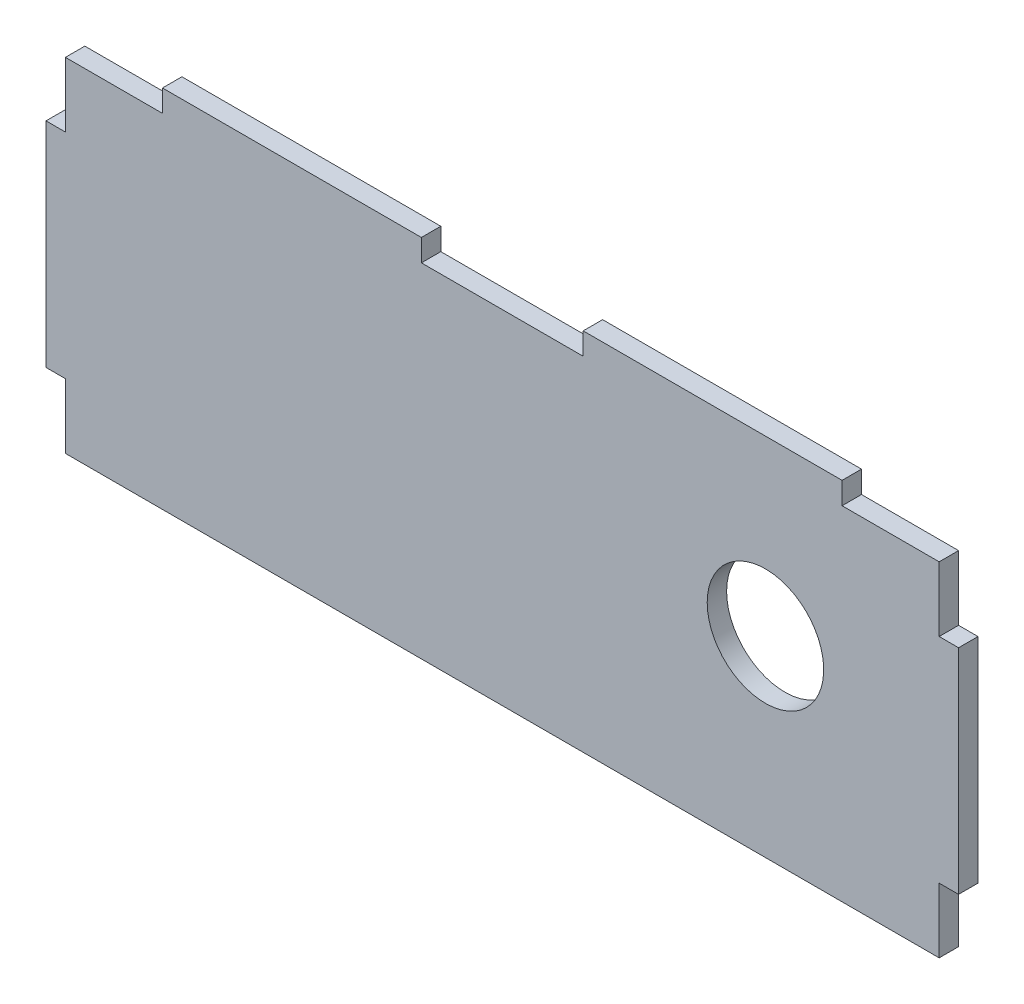
ISO-10303-21;
HEADER;
FILE_DESCRIPTION(('STEP AP214'),'2;1');
FILE_NAME('part.step','',(''),(''),'','','');
FILE_SCHEMA(('AUTOMOTIVE_DESIGN { 1 0 10303 214 1 1 1 1 }'));
ENDSEC;
DATA;
#1=APPLICATION_CONTEXT('core data for automotive mechanical design processes');
#2=APPLICATION_PROTOCOL_DEFINITION('international standard','automotive_design',2000,#1);
#3=PRODUCT_CONTEXT('',#1,'mechanical');
#4=PRODUCT('Part','Part','',(#3));
#5=PRODUCT_RELATED_PRODUCT_CATEGORY('part','',(#4));
#6=PRODUCT_DEFINITION_FORMATION('','',#4);
#7=PRODUCT_DEFINITION_CONTEXT('part definition',#1,'design');
#8=PRODUCT_DEFINITION('design','',#6,#7);
#9=PRODUCT_DEFINITION_SHAPE('','',#8);
#10=(LENGTH_UNIT() NAMED_UNIT(*) SI_UNIT(.MILLI.,.METRE.));
#11=(NAMED_UNIT(*) PLANE_ANGLE_UNIT() SI_UNIT($,.RADIAN.));
#12=(NAMED_UNIT(*) SI_UNIT($,.STERADIAN.) SOLID_ANGLE_UNIT());
#13=UNCERTAINTY_MEASURE_WITH_UNIT(LENGTH_MEASURE(1.E-05),#10,'distance_accuracy_value','');
#14=(GEOMETRIC_REPRESENTATION_CONTEXT(3) GLOBAL_UNCERTAINTY_ASSIGNED_CONTEXT((#13)) GLOBAL_UNIT_ASSIGNED_CONTEXT((#10,
#11,#12)) REPRESENTATION_CONTEXT('',''));
#15=CARTESIAN_POINT('',(0.,0.,0.));
#16=DIRECTION('',(0.,0.,1.));
#17=DIRECTION('',(1.,0.,0.));
#18=AXIS2_PLACEMENT_3D('',#15,#16,#17);
#19=CARTESIAN_POINT('',(26.4374074339526,-18.5355283268753,3.));
#20=DIRECTION('',(0.,-1.,0.));
#21=DIRECTION('',(1.,0.,0.));
#22=AXIS2_PLACEMENT_3D('',#19,#20,#21);
#23=PLANE('',#22);
#24=DIRECTION('',(0.,0.,1.));
#25=VECTOR('',#24,1.);
#26=CARTESIAN_POINT('',(-28.5625925660474,-18.5355283268753,0.));
#27=LINE('',#26,#25);
#28=CARTESIAN_POINT('',(-28.5625925660474,-18.5355283268753,0.));
#29=VERTEX_POINT('',#28);
#30=CARTESIAN_POINT('',(-28.5625925660474,-18.5355283268753,3.));
#31=VERTEX_POINT('',#30);
#32=EDGE_CURVE('E208',#29,#31,#27,.T.);
#33=ORIENTED_EDGE('',*,*,#32,.F.);
#34=DIRECTION('',(-1.,0.,0.));
#35=VECTOR('',#34,1.);
#36=CARTESIAN_POINT('',(26.4374074339526,-18.5355283268753,0.));
#37=LINE('',#36,#35);
#38=CARTESIAN_POINT('',(-53.5625925660474,-18.5355283268753,0.));
#39=VERTEX_POINT('',#38);
#40=EDGE_CURVE('E330',#29,#39,#37,.T.);
#41=ORIENTED_EDGE('',*,*,#40,.T.);
#42=DIRECTION('',(0.,0.,-1.));
#43=VECTOR('',#42,1.);
#44=CARTESIAN_POINT('',(-53.5625925660474,-18.5355283268753,0.));
#45=LINE('',#44,#43);
#46=CARTESIAN_POINT('',(-53.5625925660474,-18.5355283268753,3.));
#47=VERTEX_POINT('',#46);
#48=EDGE_CURVE('E217',#47,#39,#45,.T.);
#49=ORIENTED_EDGE('',*,*,#48,.F.);
#50=DIRECTION('',(-1.,0.,0.));
#51=VECTOR('',#50,1.);
#52=CARTESIAN_POINT('',(26.4374074339526,-18.5355283268753,3.));
#53=LINE('',#52,#51);
#54=EDGE_CURVE('E54',#31,#47,#53,.T.);
#55=ORIENTED_EDGE('',*,*,#54,.F.);
#56=EDGE_LOOP('',(#33,#41,#49,#55));
#57=FACE_BOUND('',#56,.T.);
#58=ADVANCED_FACE('F39',(#57),#23,.F.);
#59=DIRECTION('',(0.,0.,-1.));
#60=VECTOR('',#59,1.);
#61=CARTESIAN_POINT('',(11.4374074339526,-18.5355283268753,0.));
#62=LINE('',#61,#60);
#63=CARTESIAN_POINT('',(11.4374074339526,-18.5355283268753,3.));
#64=VERTEX_POINT('',#63);
#65=CARTESIAN_POINT('',(11.4374074339526,-18.5355283268753,0.));
#66=VERTEX_POINT('',#65);
#67=EDGE_CURVE('E62',#64,#66,#62,.T.);
#68=ORIENTED_EDGE('',*,*,#67,.F.);
#69=CARTESIAN_POINT('',(26.4374074339526,-18.5355283268753,3.));
#70=VERTEX_POINT('',#69);
#71=EDGE_CURVE('E315',#70,#64,#53,.T.);
#72=ORIENTED_EDGE('',*,*,#71,.F.);
#73=DIRECTION('',(0.,0.,-1.));
#74=VECTOR('',#73,1.);
#75=CARTESIAN_POINT('',(26.4374074339526,-18.5355283268753,3.));
#76=LINE('',#75,#74);
#77=CARTESIAN_POINT('',(26.4374074339526,-18.5355283268753,0.));
#78=VERTEX_POINT('',#77);
#79=EDGE_CURVE('E11',#70,#78,#76,.T.);
#80=ORIENTED_EDGE('',*,*,#79,.T.);
#81=EDGE_CURVE('E327',#78,#66,#37,.T.);
#82=ORIENTED_EDGE('',*,*,#81,.T.);
#83=EDGE_LOOP('',(#68,#72,#80,#82));
#84=FACE_BOUND('',#83,.T.);
#85=ADVANCED_FACE('F368',(#84),#23,.F.);
#86=DIRECTION('',(0.,0.,1.));
#87=VECTOR('',#86,1.);
#88=CARTESIAN_POINT('',(-93.5625925660474,-18.5355283268753,0.));
#89=LINE('',#88,#87);
#90=CARTESIAN_POINT('',(-93.5625925660474,-18.5355283268753,0.));
#91=VERTEX_POINT('',#90);
#92=CARTESIAN_POINT('',(-93.5625925660474,-18.5355283268753,3.));
#93=VERTEX_POINT('',#92);
#94=EDGE_CURVE('E204',#91,#93,#89,.T.);
#95=ORIENTED_EDGE('',*,*,#94,.F.);
#96=CARTESIAN_POINT('',(-108.562592566047,-18.5355283268753,0.));
#97=VERTEX_POINT('',#96);
#98=EDGE_CURVE('E326',#91,#97,#37,.T.);
#99=ORIENTED_EDGE('',*,*,#98,.T.);
#100=DIRECTION('',(0.,0.,-1.));
#101=VECTOR('',#100,1.);
#102=CARTESIAN_POINT('',(-108.562592566047,-18.5355283268753,3.));
#103=LINE('',#102,#101);
#104=CARTESIAN_POINT('',(-108.562592566047,-18.5355283268753,3.));
#105=VERTEX_POINT('',#104);
#106=EDGE_CURVE('E47',#105,#97,#103,.T.);
#107=ORIENTED_EDGE('',*,*,#106,.F.);
#108=EDGE_CURVE('E313',#93,#105,#53,.T.);
#109=ORIENTED_EDGE('',*,*,#108,.F.);
#110=EDGE_LOOP('',(#95,#99,#107,#109));
#111=FACE_BOUND('',#110,.T.);
#112=ADVANCED_FACE('F366',(#111),#23,.F.);
#113=CARTESIAN_POINT('',(-108.562592566047,-18.5355283268753,3.));
#114=DIRECTION('',(1.,0.,0.));
#115=DIRECTION('',(0.,1.,0.));
#116=AXIS2_PLACEMENT_3D('',#113,#114,#115);
#117=PLANE('',#116);
#118=DIRECTION('',(0.,0.,-1.));
#119=VECTOR('',#118,1.);
#120=CARTESIAN_POINT('',(-108.562592566047,-28.5355283268753,0.));
#121=LINE('',#120,#119);
#122=CARTESIAN_POINT('',(-108.562592566047,-28.5355283268753,3.));
#123=VERTEX_POINT('',#122);
#124=CARTESIAN_POINT('',(-108.562592566047,-28.5355283268753,0.));
#125=VERTEX_POINT('',#124);
#126=EDGE_CURVE('E257',#123,#125,#121,.T.);
#127=ORIENTED_EDGE('',*,*,#126,.F.);
#128=DIRECTION('',(0.,-1.,0.));
#129=VECTOR('',#128,1.);
#130=CARTESIAN_POINT('',(-108.562592566047,-18.5355283268753,3.));
#131=LINE('',#130,#129);
#132=EDGE_CURVE('E318',#105,#123,#131,.T.);
#133=ORIENTED_EDGE('',*,*,#132,.F.);
#134=ORIENTED_EDGE('',*,*,#106,.T.);
#135=DIRECTION('',(0.,-1.,0.));
#136=VECTOR('',#135,1.);
#137=CARTESIAN_POINT('',(-108.562592566047,-18.5355283268753,0.));
#138=LINE('',#137,#136);
#139=EDGE_CURVE('E331',#97,#125,#138,.T.);
#140=ORIENTED_EDGE('',*,*,#139,.T.);
#141=EDGE_LOOP('',(#127,#133,#134,#140));
#142=FACE_BOUND('',#141,.T.);
#143=ADVANCED_FACE('F344',(#142),#117,.F.);
#144=DIRECTION('',(0.,0.,1.));
#145=VECTOR('',#144,1.);
#146=CARTESIAN_POINT('',(-108.562592566047,-61.5355283268753,0.));
#147=LINE('',#146,#145);
#148=CARTESIAN_POINT('',(-108.562592566047,-61.5355283268753,0.));
#149=VERTEX_POINT('',#148);
#150=CARTESIAN_POINT('',(-108.562592566047,-61.5355283268753,3.));
#151=VERTEX_POINT('',#150);
#152=EDGE_CURVE('E228',#149,#151,#147,.T.);
#153=ORIENTED_EDGE('',*,*,#152,.F.);
#154=CARTESIAN_POINT('',(-108.562592566047,-71.5355283268753,0.));
#155=VERTEX_POINT('',#154);
#156=EDGE_CURVE('E329',#149,#155,#138,.T.);
#157=ORIENTED_EDGE('',*,*,#156,.T.);
#158=DIRECTION('',(0.,0.,-1.));
#159=VECTOR('',#158,1.);
#160=CARTESIAN_POINT('',(-108.562592566047,-71.5355283268753,3.));
#161=LINE('',#160,#159);
#162=CARTESIAN_POINT('',(-108.562592566047,-71.5355283268753,3.));
#163=VERTEX_POINT('',#162);
#164=EDGE_CURVE('E337',#163,#155,#161,.T.);
#165=ORIENTED_EDGE('',*,*,#164,.F.);
#166=EDGE_CURVE('E317',#151,#163,#131,.T.);
#167=ORIENTED_EDGE('',*,*,#166,.F.);
#168=EDGE_LOOP('',(#153,#157,#165,#167));
#169=FACE_BOUND('',#168,.T.);
#170=ADVANCED_FACE('F373',(#169),#117,.F.);
#171=CARTESIAN_POINT('',(26.4374074339526,-18.5355283268753,3.));
#172=DIRECTION('',(-1.,0.,0.));
#173=DIRECTION('',(0.,-1.,0.));
#174=AXIS2_PLACEMENT_3D('',#171,#172,#173);
#175=PLANE('',#174);
#176=DIRECTION('',(0.,0.,-1.));
#177=VECTOR('',#176,1.);
#178=CARTESIAN_POINT('',(26.4374074339526,-61.5355283268753,0.));
#179=LINE('',#178,#177);
#180=CARTESIAN_POINT('',(26.4374074339526,-61.5355283268753,3.));
#181=VERTEX_POINT('',#180);
#182=CARTESIAN_POINT('',(26.4374074339526,-61.5355283268753,0.));
#183=VERTEX_POINT('',#182);
#184=EDGE_CURVE('E287',#181,#183,#179,.T.);
#185=ORIENTED_EDGE('',*,*,#184,.F.);
#186=DIRECTION('',(0.,1.,0.));
#187=VECTOR('',#186,1.);
#188=CARTESIAN_POINT('',(26.4374074339526,-18.5355283268753,3.));
#189=LINE('',#188,#187);
#190=CARTESIAN_POINT('',(26.4374074339526,-71.5355283268753,3.));
#191=VERTEX_POINT('',#190);
#192=EDGE_CURVE('E310',#191,#181,#189,.T.);
#193=ORIENTED_EDGE('',*,*,#192,.F.);
#194=DIRECTION('',(0.,0.,-1.));
#195=VECTOR('',#194,1.);
#196=CARTESIAN_POINT('',(26.4374074339526,-71.5355283268753,3.));
#197=LINE('',#196,#195);
#198=CARTESIAN_POINT('',(26.4374074339526,-71.5355283268753,0.));
#199=VERTEX_POINT('',#198);
#200=EDGE_CURVE('E323',#191,#199,#197,.T.);
#201=ORIENTED_EDGE('',*,*,#200,.T.);
#202=DIRECTION('',(0.,1.,0.));
#203=VECTOR('',#202,1.);
#204=CARTESIAN_POINT('',(26.4374074339526,-18.5355283268753,0.));
#205=LINE('',#204,#203);
#206=EDGE_CURVE('E324',#199,#183,#205,.T.);
#207=ORIENTED_EDGE('',*,*,#206,.T.);
#208=EDGE_LOOP('',(#185,#193,#201,#207));
#209=FACE_BOUND('',#208,.T.);
#210=ADVANCED_FACE('F41',(#209),#175,.F.);
#211=DIRECTION('',(0.,0.,1.));
#212=VECTOR('',#211,1.);
#213=CARTESIAN_POINT('',(26.4374074339526,-28.5355283268753,0.));
#214=LINE('',#213,#212);
#215=CARTESIAN_POINT('',(26.4374074339526,-28.5355283268753,0.));
#216=VERTEX_POINT('',#215);
#217=CARTESIAN_POINT('',(26.4374074339526,-28.5355283268753,3.));
#218=VERTEX_POINT('',#217);
#219=EDGE_CURVE('E254',#216,#218,#214,.T.);
#220=ORIENTED_EDGE('',*,*,#219,.F.);
#221=EDGE_CURVE('E307',#216,#78,#205,.T.);
#222=ORIENTED_EDGE('',*,*,#221,.T.);
#223=ORIENTED_EDGE('',*,*,#79,.F.);
#224=EDGE_CURVE('E314',#218,#70,#189,.T.);
#225=ORIENTED_EDGE('',*,*,#224,.F.);
#226=EDGE_LOOP('',(#220,#222,#223,#225));
#227=FACE_BOUND('',#226,.T.);
#228=ADVANCED_FACE('F558',(#227),#175,.F.);
#229=CARTESIAN_POINT('',(26.4374074339526,-71.5355283268753,3.));
#230=DIRECTION('',(0.,1.,0.));
#231=DIRECTION('',(-1.,0.,0.));
#232=AXIS2_PLACEMENT_3D('',#229,#230,#231);
#233=PLANE('',#232);
#234=DIRECTION('',(1.,0.,0.));
#235=VECTOR('',#234,1.);
#236=CARTESIAN_POINT('',(26.4374074339526,-71.5355283268753,0.));
#237=LINE('',#236,#235);
#238=EDGE_CURVE('E333',#155,#199,#237,.T.);
#239=ORIENTED_EDGE('',*,*,#238,.T.);
#240=ORIENTED_EDGE('',*,*,#200,.F.);
#241=DIRECTION('',(1.,0.,0.));
#242=VECTOR('',#241,1.);
#243=CARTESIAN_POINT('',(26.4374074339526,-71.5355283268753,3.));
#244=LINE('',#243,#242);
#245=EDGE_CURVE('E321',#163,#191,#244,.T.);
#246=ORIENTED_EDGE('',*,*,#245,.F.);
#247=ORIENTED_EDGE('',*,*,#164,.T.);
#248=EDGE_LOOP('',(#239,#240,#246,#247));
#249=FACE_BOUND('',#248,.T.);
#250=ADVANCED_FACE('F393',(#249),#233,.F.);
#251=CARTESIAN_POINT('',(0.,0.,3.));
#252=DIRECTION('',(0.,0.,-1.));
#253=DIRECTION('',(-1.,0.,0.));
#254=AXIS2_PLACEMENT_3D('',#251,#252,#253);
#255=PLANE('',#254);
#256=CARTESIAN_POINT('',(-0.403677713422929,-41.8991903095299,3.));
#257=DIRECTION('',(0.,0.,-1.));
#258=DIRECTION('',(-1.,0.,0.));
#259=AXIS2_PLACEMENT_3D('',#256,#257,#258);
#260=CIRCLE('',#259,8.99999999999998);
#261=CARTESIAN_POINT('',(-9.40367771342291,-41.8991903095299,3.));
#262=VERTEX_POINT('',#261);
#263=EDGE_CURVE('E304',#262,#262,#260,.T.);
#264=ORIENTED_EDGE('',*,*,#263,.T.);
#265=EDGE_LOOP('',(#264));
#266=FACE_BOUND('',#265,.T.);
#267=ORIENTED_EDGE('',*,*,#192,.T.);
#268=DIRECTION('',(-1.,0.,0.));
#269=VECTOR('',#268,1.);
#270=CARTESIAN_POINT('',(62.5734904855144,-61.5355283268753,3.));
#271=LINE('',#270,#269);
#272=CARTESIAN_POINT('',(29.4374074339526,-61.5355283268753,3.));
#273=VERTEX_POINT('',#272);
#274=EDGE_CURVE('E293',#273,#181,#271,.T.);
#275=ORIENTED_EDGE('',*,*,#274,.F.);
#276=DIRECTION('',(0.,1.,0.));
#277=VECTOR('',#276,1.);
#278=CARTESIAN_POINT('',(29.4374074339526,-28.5355283268753,3.));
#279=LINE('',#278,#277);
#280=CARTESIAN_POINT('',(29.4374074339526,-28.5355283268753,3.));
#281=VERTEX_POINT('',#280);
#282=EDGE_CURVE('E274',#273,#281,#279,.T.);
#283=ORIENTED_EDGE('',*,*,#282,.T.);
#284=DIRECTION('',(-1.,0.,0.));
#285=VECTOR('',#284,1.);
#286=CARTESIAN_POINT('',(62.5734904855144,-28.5355283268753,3.));
#287=LINE('',#286,#285);
#288=EDGE_CURVE('E296',#281,#218,#287,.T.);
#289=ORIENTED_EDGE('',*,*,#288,.T.);
#290=ORIENTED_EDGE('',*,*,#224,.T.);
#291=ORIENTED_EDGE('',*,*,#71,.T.);
#292=DIRECTION('',(0.,-1.,0.));
#293=VECTOR('',#292,1.);
#294=CARTESIAN_POINT('',(11.4374074339526,24.9768139133916,3.));
#295=LINE('',#294,#293);
#296=CARTESIAN_POINT('',(11.4374074339526,-15.1355283268716,3.));
#297=VERTEX_POINT('',#296);
#298=EDGE_CURVE('E214',#297,#64,#295,.T.);
#299=ORIENTED_EDGE('',*,*,#298,.F.);
#300=DIRECTION('',(1.,0.,0.));
#301=VECTOR('',#300,1.);
#302=CARTESIAN_POINT('',(-28.5625925660474,-15.1355283268716,3.));
#303=LINE('',#302,#301);
#304=CARTESIAN_POINT('',(-28.5625925660474,-15.1355283268716,3.));
#305=VERTEX_POINT('',#304);
#306=EDGE_CURVE('E200',#305,#297,#303,.T.);
#307=ORIENTED_EDGE('',*,*,#306,.F.);
#308=DIRECTION('',(0.,-1.,0.));
#309=VECTOR('',#308,1.);
#310=CARTESIAN_POINT('',(-28.5625925660474,24.9768139133916,3.));
#311=LINE('',#310,#309);
#312=EDGE_CURVE('E212',#305,#31,#311,.T.);
#313=ORIENTED_EDGE('',*,*,#312,.T.);
#314=ORIENTED_EDGE('',*,*,#54,.T.);
#315=DIRECTION('',(0.,-1.,0.));
#316=VECTOR('',#315,1.);
#317=CARTESIAN_POINT('',(-53.5625925660474,24.9768139133916,3.));
#318=LINE('',#317,#316);
#319=CARTESIAN_POINT('',(-53.5625925660474,-15.1355283268716,3.));
#320=VERTEX_POINT('',#319);
#321=EDGE_CURVE('E221',#320,#47,#318,.T.);
#322=ORIENTED_EDGE('',*,*,#321,.F.);
#323=DIRECTION('',(1.,0.,0.));
#324=VECTOR('',#323,1.);
#325=CARTESIAN_POINT('',(-93.5625925660474,-15.1355283268716,3.));
#326=LINE('',#325,#324);
#327=CARTESIAN_POINT('',(-93.5625925660474,-15.1355283268716,3.));
#328=VERTEX_POINT('',#327);
#329=EDGE_CURVE('E229',#328,#320,#326,.T.);
#330=ORIENTED_EDGE('',*,*,#329,.F.);
#331=DIRECTION('',(0.,-1.,0.));
#332=VECTOR('',#331,1.);
#333=CARTESIAN_POINT('',(-93.5625925660474,24.9768139133916,3.));
#334=LINE('',#333,#332);
#335=EDGE_CURVE('E224',#328,#93,#334,.T.);
#336=ORIENTED_EDGE('',*,*,#335,.T.);
#337=ORIENTED_EDGE('',*,*,#108,.T.);
#338=ORIENTED_EDGE('',*,*,#132,.T.);
#339=DIRECTION('',(1.,0.,0.));
#340=VECTOR('',#339,1.);
#341=CARTESIAN_POINT('',(-144.698675617609,-28.5355283268753,3.));
#342=LINE('',#341,#340);
#343=CARTESIAN_POINT('',(-111.562592566047,-28.5355283268753,3.));
#344=VERTEX_POINT('',#343);
#345=EDGE_CURVE('E263',#344,#123,#342,.T.);
#346=ORIENTED_EDGE('',*,*,#345,.F.);
#347=DIRECTION('',(0.,-1.,0.));
#348=VECTOR('',#347,1.);
#349=CARTESIAN_POINT('',(-111.562592566047,-61.5355283268753,3.));
#350=LINE('',#349,#348);
#351=CARTESIAN_POINT('',(-111.562592566047,-61.5355283268753,3.));
#352=VERTEX_POINT('',#351);
#353=EDGE_CURVE('E244',#344,#352,#350,.T.);
#354=ORIENTED_EDGE('',*,*,#353,.T.);
#355=DIRECTION('',(1.,0.,0.));
#356=VECTOR('',#355,1.);
#357=CARTESIAN_POINT('',(-144.698675617609,-61.5355283268753,3.));
#358=LINE('',#357,#356);
#359=EDGE_CURVE('E266',#352,#151,#358,.T.);
#360=ORIENTED_EDGE('',*,*,#359,.T.);
#361=ORIENTED_EDGE('',*,*,#166,.T.);
#362=ORIENTED_EDGE('',*,*,#245,.T.);
#363=EDGE_LOOP('',(#267,#275,#283,#289,#290,#291,#299,#307,#313,#314,#322,#330,#336,#337,#338,
#346,#354,#360,#361,#362));
#364=FACE_BOUND('',#363,.T.);
#365=ADVANCED_FACE('F353',(#266,#364),#255,.F.);
#366=CARTESIAN_POINT('',(0.,0.,0.));
#367=DIRECTION('',(0.,0.,-1.));
#368=DIRECTION('',(-1.,0.,0.));
#369=AXIS2_PLACEMENT_3D('',#366,#367,#368);
#370=PLANE('',#369);
#371=CARTESIAN_POINT('',(-0.403677713422929,-41.8991903095299,0.));
#372=DIRECTION('',(0.,0.,-1.));
#373=DIRECTION('',(-1.,0.,0.));
#374=AXIS2_PLACEMENT_3D('',#371,#372,#373);
#375=CIRCLE('',#374,8.99999999999998);
#376=CARTESIAN_POINT('',(-9.40367771342291,-41.8991903095299,0.));
#377=VERTEX_POINT('',#376);
#378=EDGE_CURVE('E284',#377,#377,#375,.T.);
#379=ORIENTED_EDGE('',*,*,#378,.F.);
#380=EDGE_LOOP('',(#379));
#381=FACE_BOUND('',#380,.T.);
#382=ORIENTED_EDGE('',*,*,#206,.F.);
#383=ORIENTED_EDGE('',*,*,#238,.F.);
#384=ORIENTED_EDGE('',*,*,#156,.F.);
#385=DIRECTION('',(1.,0.,0.));
#386=VECTOR('',#385,1.);
#387=CARTESIAN_POINT('',(-144.698675617609,-61.5355283268753,0.));
#388=LINE('',#387,#386);
#389=CARTESIAN_POINT('',(-111.562592566047,-61.5355283268753,0.));
#390=VERTEX_POINT('',#389);
#391=EDGE_CURVE('E269',#390,#149,#388,.T.);
#392=ORIENTED_EDGE('',*,*,#391,.F.);
#393=DIRECTION('',(0.,1.,0.));
#394=VECTOR('',#393,1.);
#395=CARTESIAN_POINT('',(-111.562592566047,-61.5355283268753,0.));
#396=LINE('',#395,#394);
#397=CARTESIAN_POINT('',(-111.562592566047,-28.5355283268753,0.));
#398=VERTEX_POINT('',#397);
#399=EDGE_CURVE('E251',#390,#398,#396,.T.);
#400=ORIENTED_EDGE('',*,*,#399,.T.);
#401=DIRECTION('',(1.,0.,0.));
#402=VECTOR('',#401,1.);
#403=CARTESIAN_POINT('',(-144.698675617609,-28.5355283268753,0.));
#404=LINE('',#403,#402);
#405=EDGE_CURVE('E260',#398,#125,#404,.T.);
#406=ORIENTED_EDGE('',*,*,#405,.T.);
#407=ORIENTED_EDGE('',*,*,#139,.F.);
#408=ORIENTED_EDGE('',*,*,#98,.F.);
#409=DIRECTION('',(0.,-1.,0.));
#410=VECTOR('',#409,1.);
#411=CARTESIAN_POINT('',(-93.5625925660474,24.9768139133916,0.));
#412=LINE('',#411,#410);
#413=CARTESIAN_POINT('',(-93.5625925660474,-15.1355283268716,0.));
#414=VERTEX_POINT('',#413);
#415=EDGE_CURVE('E201',#414,#91,#412,.T.);
#416=ORIENTED_EDGE('',*,*,#415,.F.);
#417=DIRECTION('',(-1.,0.,0.));
#418=VECTOR('',#417,1.);
#419=CARTESIAN_POINT('',(-93.5625925660474,-15.1355283268716,0.));
#420=LINE('',#419,#418);
#421=CARTESIAN_POINT('',(-53.5625925660474,-15.1355283268716,0.));
#422=VERTEX_POINT('',#421);
#423=EDGE_CURVE('E235',#422,#414,#420,.T.);
#424=ORIENTED_EDGE('',*,*,#423,.F.);
#425=DIRECTION('',(0.,-1.,0.));
#426=VECTOR('',#425,1.);
#427=CARTESIAN_POINT('',(-53.5625925660474,24.9768139133916,0.));
#428=LINE('',#427,#426);
#429=EDGE_CURVE('E220',#422,#39,#428,.T.);
#430=ORIENTED_EDGE('',*,*,#429,.T.);
#431=ORIENTED_EDGE('',*,*,#40,.F.);
#432=DIRECTION('',(0.,-1.,0.));
#433=VECTOR('',#432,1.);
#434=CARTESIAN_POINT('',(-28.5625925660474,24.9768139133916,0.));
#435=LINE('',#434,#433);
#436=CARTESIAN_POINT('',(-28.5625925660474,-15.1355283268716,0.));
#437=VERTEX_POINT('',#436);
#438=EDGE_CURVE('E192',#437,#29,#435,.T.);
#439=ORIENTED_EDGE('',*,*,#438,.F.);
#440=DIRECTION('',(-1.,0.,0.));
#441=VECTOR('',#440,1.);
#442=CARTESIAN_POINT('',(-28.5625925660474,-15.1355283268716,0.));
#443=LINE('',#442,#441);
#444=CARTESIAN_POINT('',(11.4374074339526,-15.1355283268716,0.));
#445=VERTEX_POINT('',#444);
#446=EDGE_CURVE('E186',#445,#437,#443,.T.);
#447=ORIENTED_EDGE('',*,*,#446,.F.);
#448=DIRECTION('',(0.,-1.,0.));
#449=VECTOR('',#448,1.);
#450=CARTESIAN_POINT('',(11.4374074339526,24.9768139133916,0.));
#451=LINE('',#450,#449);
#452=EDGE_CURVE('E177',#445,#66,#451,.T.);
#453=ORIENTED_EDGE('',*,*,#452,.T.);
#454=ORIENTED_EDGE('',*,*,#81,.F.);
#455=ORIENTED_EDGE('',*,*,#221,.F.);
#456=DIRECTION('',(-1.,0.,0.));
#457=VECTOR('',#456,1.);
#458=CARTESIAN_POINT('',(62.5734904855144,-28.5355283268753,0.));
#459=LINE('',#458,#457);
#460=CARTESIAN_POINT('',(29.4374074339526,-28.5355283268753,0.));
#461=VERTEX_POINT('',#460);
#462=EDGE_CURVE('E299',#461,#216,#459,.T.);
#463=ORIENTED_EDGE('',*,*,#462,.F.);
#464=DIRECTION('',(0.,-1.,0.));
#465=VECTOR('',#464,1.);
#466=CARTESIAN_POINT('',(29.4374074339526,-28.5355283268753,0.));
#467=LINE('',#466,#465);
#468=CARTESIAN_POINT('',(29.4374074339526,-61.5355283268753,0.));
#469=VERTEX_POINT('',#468);
#470=EDGE_CURVE('E281',#461,#469,#467,.T.);
#471=ORIENTED_EDGE('',*,*,#470,.T.);
#472=DIRECTION('',(-1.,0.,0.));
#473=VECTOR('',#472,1.);
#474=CARTESIAN_POINT('',(62.5734904855144,-61.5355283268753,0.));
#475=LINE('',#474,#473);
#476=EDGE_CURVE('E290',#469,#183,#475,.T.);
#477=ORIENTED_EDGE('',*,*,#476,.T.);
#478=EDGE_LOOP('',(#382,#383,#384,#392,#400,#406,#407,#408,#416,#424,#430,#431,#439,#447,#453,
#454,#455,#463,#471,#477));
#479=FACE_BOUND('',#478,.T.);
#480=ADVANCED_FACE('F190',(#381,#479),#370,.T.);
#481=CARTESIAN_POINT('',(-0.403677713422929,-41.8991903095299,3.));
#482=DIRECTION('',(0.,0.,-1.));
#483=DIRECTION('',(-1.,0.,0.));
#484=AXIS2_PLACEMENT_3D('',#481,#482,#483);
#485=CYLINDRICAL_SURFACE('',#484,8.99999999999998);
#486=ORIENTED_EDGE('',*,*,#263,.F.);
#487=EDGE_LOOP('',(#486));
#488=FACE_BOUND('',#487,.T.);
#489=ORIENTED_EDGE('',*,*,#378,.T.);
#490=EDGE_LOOP('',(#489));
#491=FACE_BOUND('',#490,.T.);
#492=ADVANCED_FACE('F405',(#488,#491),#485,.F.);
#493=CARTESIAN_POINT('',(62.5734904855144,-61.5355283268753,0.));
#494=DIRECTION('',(0.,1.,0.));
#495=DIRECTION('',(0.,0.,1.));
#496=AXIS2_PLACEMENT_3D('',#493,#494,#495);
#497=PLANE('',#496);
#498=ORIENTED_EDGE('',*,*,#476,.F.);
#499=DIRECTION('',(0.,0.,1.));
#500=VECTOR('',#499,1.);
#501=CARTESIAN_POINT('',(29.4374074339526,-61.5355283268753,0.));
#502=LINE('',#501,#500);
#503=EDGE_CURVE('E278',#469,#273,#502,.T.);
#504=ORIENTED_EDGE('',*,*,#503,.T.);
#505=ORIENTED_EDGE('',*,*,#274,.T.);
#506=ORIENTED_EDGE('',*,*,#184,.T.);
#507=EDGE_LOOP('',(#498,#504,#505,#506));
#508=FACE_BOUND('',#507,.T.);
#509=ADVANCED_FACE('F513',(#508),#497,.F.);
#510=CARTESIAN_POINT('',(62.5734904855144,-28.5355283268753,0.));
#511=DIRECTION('',(0.,-1.,0.));
#512=DIRECTION('',(0.,0.,-1.));
#513=AXIS2_PLACEMENT_3D('',#510,#511,#512);
#514=PLANE('',#513);
#515=ORIENTED_EDGE('',*,*,#288,.F.);
#516=DIRECTION('',(0.,0.,-1.));
#517=VECTOR('',#516,1.);
#518=CARTESIAN_POINT('',(29.4374074339526,-28.5355283268753,0.));
#519=LINE('',#518,#517);
#520=EDGE_CURVE('E277',#281,#461,#519,.T.);
#521=ORIENTED_EDGE('',*,*,#520,.T.);
#522=ORIENTED_EDGE('',*,*,#462,.T.);
#523=ORIENTED_EDGE('',*,*,#219,.T.);
#524=EDGE_LOOP('',(#515,#521,#522,#523));
#525=FACE_BOUND('',#524,.T.);
#526=ADVANCED_FACE('F502',(#525),#514,.F.);
#527=CARTESIAN_POINT('',(29.4374074339526,0.,0.));
#528=DIRECTION('',(-1.,0.,0.));
#529=DIRECTION('',(0.,0.,1.));
#530=AXIS2_PLACEMENT_3D('',#527,#528,#529);
#531=PLANE('',#530);
#532=ORIENTED_EDGE('',*,*,#520,.F.);
#533=ORIENTED_EDGE('',*,*,#282,.F.);
#534=ORIENTED_EDGE('',*,*,#503,.F.);
#535=ORIENTED_EDGE('',*,*,#470,.F.);
#536=EDGE_LOOP('',(#532,#533,#534,#535));
#537=FACE_BOUND('',#536,.T.);
#538=ADVANCED_FACE('F492',(#537),#531,.F.);
#539=CARTESIAN_POINT('',(-144.698675617609,-28.5355283268753,0.));
#540=DIRECTION('',(0.,-1.,0.));
#541=DIRECTION('',(0.,0.,-1.));
#542=AXIS2_PLACEMENT_3D('',#539,#540,#541);
#543=PLANE('',#542);
#544=ORIENTED_EDGE('',*,*,#405,.F.);
#545=DIRECTION('',(0.,0.,1.));
#546=VECTOR('',#545,1.);
#547=CARTESIAN_POINT('',(-111.562592566047,-28.5355283268753,0.));
#548=LINE('',#547,#546);
#549=EDGE_CURVE('E248',#398,#344,#548,.T.);
#550=ORIENTED_EDGE('',*,*,#549,.T.);
#551=ORIENTED_EDGE('',*,*,#345,.T.);
#552=ORIENTED_EDGE('',*,*,#126,.T.);
#553=EDGE_LOOP('',(#544,#550,#551,#552));
#554=FACE_BOUND('',#553,.T.);
#555=ADVANCED_FACE('F350',(#554),#543,.F.);
#556=CARTESIAN_POINT('',(-144.698675617609,-61.5355283268753,0.));
#557=DIRECTION('',(0.,1.,0.));
#558=DIRECTION('',(0.,0.,1.));
#559=AXIS2_PLACEMENT_3D('',#556,#557,#558);
#560=PLANE('',#559);
#561=ORIENTED_EDGE('',*,*,#359,.F.);
#562=DIRECTION('',(0.,0.,-1.));
#563=VECTOR('',#562,1.);
#564=CARTESIAN_POINT('',(-111.562592566047,-61.5355283268753,0.));
#565=LINE('',#564,#563);
#566=EDGE_CURVE('E247',#352,#390,#565,.T.);
#567=ORIENTED_EDGE('',*,*,#566,.T.);
#568=ORIENTED_EDGE('',*,*,#391,.T.);
#569=ORIENTED_EDGE('',*,*,#152,.T.);
#570=EDGE_LOOP('',(#561,#567,#568,#569));
#571=FACE_BOUND('',#570,.T.);
#572=ADVANCED_FACE('F472',(#571),#560,.F.);
#573=CARTESIAN_POINT('',(-111.562592566047,0.,0.));
#574=DIRECTION('',(1.,0.,0.));
#575=DIRECTION('',(0.,0.,-1.));
#576=AXIS2_PLACEMENT_3D('',#573,#574,#575);
#577=PLANE('',#576);
#578=ORIENTED_EDGE('',*,*,#566,.F.);
#579=ORIENTED_EDGE('',*,*,#353,.F.);
#580=ORIENTED_EDGE('',*,*,#549,.F.);
#581=ORIENTED_EDGE('',*,*,#399,.F.);
#582=EDGE_LOOP('',(#578,#579,#580,#581));
#583=FACE_BOUND('',#582,.T.);
#584=ADVANCED_FACE('F463',(#583),#577,.F.);
#585=CARTESIAN_POINT('',(-93.5625925660474,24.9768139133916,0.));
#586=DIRECTION('',(1.,0.,0.));
#587=DIRECTION('',(0.,0.,-1.));
#588=AXIS2_PLACEMENT_3D('',#585,#586,#587);
#589=PLANE('',#588);
#590=DIRECTION('',(0.,0.,1.));
#591=VECTOR('',#590,1.);
#592=CARTESIAN_POINT('',(-93.5625925660474,-15.1355283268716,0.));
#593=LINE('',#592,#591);
#594=EDGE_CURVE('E232',#414,#328,#593,.T.);
#595=ORIENTED_EDGE('',*,*,#594,.F.);
#596=ORIENTED_EDGE('',*,*,#415,.T.);
#597=ORIENTED_EDGE('',*,*,#94,.T.);
#598=ORIENTED_EDGE('',*,*,#335,.F.);
#599=EDGE_LOOP('',(#595,#596,#597,#598));
#600=FACE_BOUND('',#599,.T.);
#601=ADVANCED_FACE('F365',(#600),#589,.F.);
#602=CARTESIAN_POINT('',(-53.5625925660474,24.9768139133916,0.));
#603=DIRECTION('',(-1.,0.,0.));
#604=DIRECTION('',(0.,0.,1.));
#605=AXIS2_PLACEMENT_3D('',#602,#603,#604);
#606=PLANE('',#605);
#607=DIRECTION('',(0.,0.,-1.));
#608=VECTOR('',#607,1.);
#609=CARTESIAN_POINT('',(-53.5625925660474,-15.1355283268716,0.));
#610=LINE('',#609,#608);
#611=EDGE_CURVE('E225',#320,#422,#610,.T.);
#612=ORIENTED_EDGE('',*,*,#611,.F.);
#613=ORIENTED_EDGE('',*,*,#321,.T.);
#614=ORIENTED_EDGE('',*,*,#48,.T.);
#615=ORIENTED_EDGE('',*,*,#429,.F.);
#616=EDGE_LOOP('',(#612,#613,#614,#615));
#617=FACE_BOUND('',#616,.T.);
#618=ADVANCED_FACE('F359',(#617),#606,.F.);
#619=CARTESIAN_POINT('',(-2.68257638325053E-11,-15.1355283268716,-7.9658502016855E-12));
#620=DIRECTION('',(0.,1.,0.));
#621=DIRECTION('',(1.,0.,0.));
#622=AXIS2_PLACEMENT_3D('',#619,#620,#621);
#623=PLANE('',#622);
#624=ORIENTED_EDGE('',*,*,#423,.T.);
#625=ORIENTED_EDGE('',*,*,#594,.T.);
#626=ORIENTED_EDGE('',*,*,#329,.T.);
#627=ORIENTED_EDGE('',*,*,#611,.T.);
#628=EDGE_LOOP('',(#624,#625,#626,#627));
#629=FACE_BOUND('',#628,.T.);
#630=ADVANCED_FACE('F362',(#629),#623,.T.);
#631=CARTESIAN_POINT('',(-28.5625925660474,24.9768139133916,0.));
#632=DIRECTION('',(1.,0.,0.));
#633=DIRECTION('',(0.,0.,-1.));
#634=AXIS2_PLACEMENT_3D('',#631,#632,#633);
#635=PLANE('',#634);
#636=DIRECTION('',(0.,0.,1.));
#637=VECTOR('',#636,1.);
#638=CARTESIAN_POINT('',(-28.5625925660474,-15.1355283268716,0.));
#639=LINE('',#638,#637);
#640=EDGE_CURVE('E196',#437,#305,#639,.T.);
#641=ORIENTED_EDGE('',*,*,#640,.F.);
#642=ORIENTED_EDGE('',*,*,#438,.T.);
#643=ORIENTED_EDGE('',*,*,#32,.T.);
#644=ORIENTED_EDGE('',*,*,#312,.F.);
#645=EDGE_LOOP('',(#641,#642,#643,#644));
#646=FACE_BOUND('',#645,.T.);
#647=ADVANCED_FACE('F414',(#646),#635,.F.);
#648=CARTESIAN_POINT('',(11.4374074339526,24.9768139133916,0.));
#649=DIRECTION('',(-1.,0.,0.));
#650=DIRECTION('',(0.,0.,1.));
#651=AXIS2_PLACEMENT_3D('',#648,#649,#650);
#652=PLANE('',#651);
#653=DIRECTION('',(0.,0.,-1.));
#654=VECTOR('',#653,1.);
#655=CARTESIAN_POINT('',(11.4374074339526,-15.1355283268716,0.));
#656=LINE('',#655,#654);
#657=EDGE_CURVE('E182',#297,#445,#656,.T.);
#658=ORIENTED_EDGE('',*,*,#657,.F.);
#659=ORIENTED_EDGE('',*,*,#298,.T.);
#660=ORIENTED_EDGE('',*,*,#67,.T.);
#661=ORIENTED_EDGE('',*,*,#452,.F.);
#662=EDGE_LOOP('',(#658,#659,#660,#661));
#663=FACE_BOUND('',#662,.T.);
#664=ADVANCED_FACE('F179',(#663),#652,.F.);
#665=CARTESIAN_POINT('',(-2.68257638325053E-11,-15.1355283268716,-7.9658502016855E-12));
#666=DIRECTION('',(0.,1.,0.));
#667=DIRECTION('',(1.,0.,0.));
#668=AXIS2_PLACEMENT_3D('',#665,#666,#667);
#669=PLANE('',#668);
#670=ORIENTED_EDGE('',*,*,#446,.T.);
#671=ORIENTED_EDGE('',*,*,#640,.T.);
#672=ORIENTED_EDGE('',*,*,#306,.T.);
#673=ORIENTED_EDGE('',*,*,#657,.T.);
#674=EDGE_LOOP('',(#670,#671,#672,#673));
#675=FACE_BOUND('',#674,.T.);
#676=ADVANCED_FACE('F199',(#675),#669,.T.);
#677=CLOSED_SHELL('',(#58,#85,#112,#143,#170,#210,#228,#250,#365,#480,#492,#509,#526,#538,#555,
#572,#584,#601,#618,#630,#647,#664,#676));
#678=MANIFOLD_SOLID_BREP('B2',#677);
#679=ADVANCED_BREP_SHAPE_REPRESENTATION('',(#18,#678),#14);
#680=SHAPE_DEFINITION_REPRESENTATION(#9,#679);
ENDSEC;
END-ISO-10303-21;
